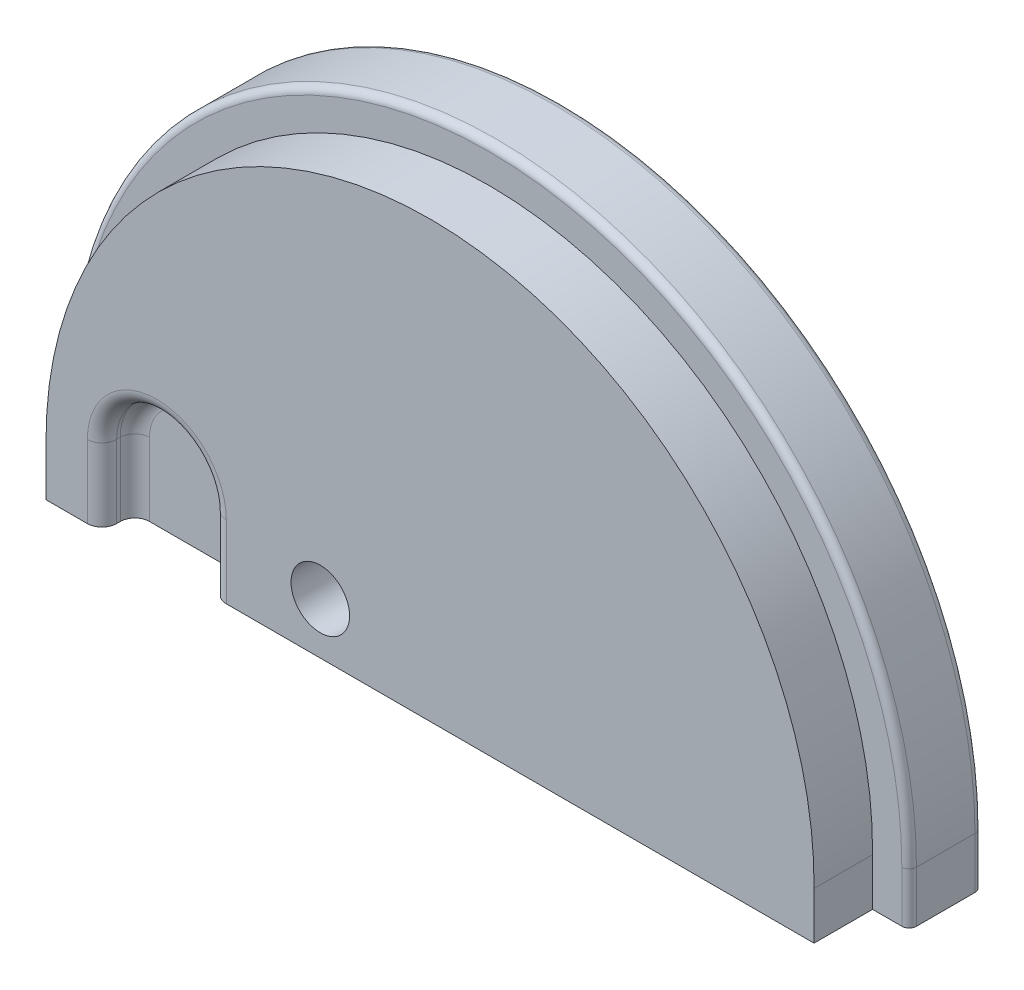
ISO-10303-21;
HEADER;
FILE_DESCRIPTION(('STEP AP214'),'2;1');
FILE_NAME('part.step','',(''),(''),'','','');
FILE_SCHEMA(('AUTOMOTIVE_DESIGN { 1 0 10303 214 1 1 1 1 }'));
ENDSEC;
DATA;
#1=APPLICATION_CONTEXT('core data for automotive mechanical design processes');
#2=APPLICATION_PROTOCOL_DEFINITION('international standard','automotive_design',2000,#1);
#3=PRODUCT_CONTEXT('',#1,'mechanical');
#4=PRODUCT('Part','Part','',(#3));
#5=PRODUCT_RELATED_PRODUCT_CATEGORY('part','',(#4));
#6=PRODUCT_DEFINITION_FORMATION('','',#4);
#7=PRODUCT_DEFINITION_CONTEXT('part definition',#1,'design');
#8=PRODUCT_DEFINITION('design','',#6,#7);
#9=PRODUCT_DEFINITION_SHAPE('','',#8);
#10=(LENGTH_UNIT() NAMED_UNIT(*) SI_UNIT(.MILLI.,.METRE.));
#11=(NAMED_UNIT(*) PLANE_ANGLE_UNIT() SI_UNIT($,.RADIAN.));
#12=(NAMED_UNIT(*) SI_UNIT($,.STERADIAN.) SOLID_ANGLE_UNIT());
#13=UNCERTAINTY_MEASURE_WITH_UNIT(LENGTH_MEASURE(1.E-05),#10,'distance_accuracy_value','');
#14=(GEOMETRIC_REPRESENTATION_CONTEXT(3) GLOBAL_UNCERTAINTY_ASSIGNED_CONTEXT((#13)) GLOBAL_UNIT_ASSIGNED_CONTEXT((#10,
#11,#12)) REPRESENTATION_CONTEXT('',''));
#15=CARTESIAN_POINT('',(0.,0.,0.));
#16=DIRECTION('',(0.,0.,1.));
#17=DIRECTION('',(1.,0.,0.));
#18=AXIS2_PLACEMENT_3D('',#15,#16,#17);
#19=CARTESIAN_POINT('',(49.7401472728543,48.7881442927304,-8.));
#20=DIRECTION('',(0.,1.,0.));
#21=DIRECTION('',(0.,0.,-1.));
#22=AXIS2_PLACEMENT_3D('',#19,#20,#21);
#23=PLANE('',#22);
#24=DIRECTION('',(0.,0.,1.));
#25=VECTOR('',#24,1.);
#26=CARTESIAN_POINT('',(72.3917820401487,48.7881442927304,-4.5));
#27=LINE('',#26,#25);
#28=CARTESIAN_POINT('',(72.3917820401487,48.7881442927304,-2.5));
#29=VERTEX_POINT('',#28);
#30=CARTESIAN_POINT('',(72.3917820401487,48.7881442927304,-2.));
#31=VERTEX_POINT('',#30);
#32=EDGE_CURVE('E355',#29,#31,#27,.T.);
#33=ORIENTED_EDGE('',*,*,#32,.F.);
#34=CARTESIAN_POINT('',(70.3917820401487,48.7881442927304,-2.5));
#35=DIRECTION('',(0.,-1.,0.));
#36=DIRECTION('',(0.,0.,-1.));
#37=AXIS2_PLACEMENT_3D('',#34,#35,#36);
#38=CIRCLE('',#37,2.);
#39=CARTESIAN_POINT('',(70.3917820401487,48.7881442927304,-4.5));
#40=VERTEX_POINT('',#39);
#41=EDGE_CURVE('E11',#40,#29,#38,.T.);
#42=ORIENTED_EDGE('',*,*,#41,.F.);
#43=DIRECTION('',(1.,0.,0.));
#44=VECTOR('',#43,1.);
#45=CARTESIAN_POINT('',(72.3917820401487,48.7881442927304,-4.5));
#46=LINE('',#45,#44);
#47=CARTESIAN_POINT('',(59.3917820401487,48.7881442927304,-4.5));
#48=VERTEX_POINT('',#47);
#49=EDGE_CURVE('E345',#48,#40,#46,.T.);
#50=ORIENTED_EDGE('',*,*,#49,.F.);
#51=CARTESIAN_POINT('',(59.3917820401487,48.7881442927304,-2.5));
#52=DIRECTION('',(0.,-1.,0.));
#53=DIRECTION('',(0.,0.,-1.));
#54=AXIS2_PLACEMENT_3D('',#51,#52,#53);
#55=CIRCLE('',#54,2.);
#56=CARTESIAN_POINT('',(57.3917820401487,48.7881442927304,-2.5));
#57=VERTEX_POINT('',#56);
#58=EDGE_CURVE('E42',#57,#48,#55,.T.);
#59=ORIENTED_EDGE('',*,*,#58,.F.);
#60=DIRECTION('',(0.,0.,1.));
#61=VECTOR('',#60,1.);
#62=CARTESIAN_POINT('',(57.3917820401487,48.7881442927304,-4.5));
#63=LINE('',#62,#61);
#64=CARTESIAN_POINT('',(57.3917820401487,48.7881442927304,-2.));
#65=VERTEX_POINT('',#64);
#66=EDGE_CURVE('E360',#57,#65,#63,.T.);
#67=ORIENTED_EDGE('',*,*,#66,.T.);
#68=CARTESIAN_POINT('',(55.3917820401487,48.7881442927304,-2.));
#69=DIRECTION('',(0.,-1.,0.));
#70=DIRECTION('',(0.,0.,-1.));
#71=AXIS2_PLACEMENT_3D('',#68,#69,#70);
#72=CIRCLE('',#71,2.);
#73=CARTESIAN_POINT('',(55.3917820401487,48.7881442927304,0.));
#74=VERTEX_POINT('',#73);
#75=EDGE_CURVE('E318',#74,#65,#72,.F.);
#76=ORIENTED_EDGE('',*,*,#75,.F.);
#77=DIRECTION('',(1.,0.,0.));
#78=VECTOR('',#77,1.);
#79=CARTESIAN_POINT('',(49.7401472728543,48.7881442927304,0.));
#80=LINE('',#79,#78);
#81=CARTESIAN_POINT('',(49.7401472728543,48.7881442927304,0.));
#82=VERTEX_POINT('',#81);
#83=EDGE_CURVE('E198',#82,#74,#80,.T.);
#84=ORIENTED_EDGE('',*,*,#83,.F.);
#85=DIRECTION('',(0.,0.,1.));
#86=VECTOR('',#85,1.);
#87=CARTESIAN_POINT('',(49.7401472728543,48.7881442927304,-8.));
#88=LINE('',#87,#86);
#89=CARTESIAN_POINT('',(49.7401472728543,48.7881442927297,-8.));
#90=VERTEX_POINT('',#89);
#91=EDGE_CURVE('E176',#90,#82,#88,.T.);
#92=ORIENTED_EDGE('',*,*,#91,.F.);
#93=DIRECTION('',(1.,0.,0.));
#94=VECTOR('',#93,1.);
#95=CARTESIAN_POINT('',(159.740147272854,48.7881442927297,-8.));
#96=LINE('',#95,#94);
#97=CARTESIAN_POINT('',(45.7401472728544,48.7881442927297,-8.));
#98=VERTEX_POINT('',#97);
#99=EDGE_CURVE('E184',#98,#90,#96,.T.);
#100=ORIENTED_EDGE('',*,*,#99,.F.);
#101=CARTESIAN_POINT('',(45.7401472728544,48.7881442927304,-9.));
#102=DIRECTION('',(0.,-1.,0.));
#103=DIRECTION('',(0.,0.,-1.));
#104=AXIS2_PLACEMENT_3D('',#101,#102,#103);
#105=CIRCLE('',#104,1.);
#106=CARTESIAN_POINT('',(44.7401472728544,48.7881442927297,-9.));
#107=VERTEX_POINT('',#106);
#108=EDGE_CURVE('E275',#107,#98,#105,.F.);
#109=ORIENTED_EDGE('',*,*,#108,.F.);
#110=DIRECTION('',(0.,0.,1.));
#111=VECTOR('',#110,1.);
#112=CARTESIAN_POINT('',(44.7401472728544,48.7881442927297,-18.));
#113=LINE('',#112,#111);
#114=CARTESIAN_POINT('',(44.7401472728544,48.7881442927297,-17.));
#115=VERTEX_POINT('',#114);
#116=EDGE_CURVE('E250',#115,#107,#113,.T.);
#117=ORIENTED_EDGE('',*,*,#116,.F.);
#118=CARTESIAN_POINT('',(45.7401472728544,48.7881442927304,-17.));
#119=DIRECTION('',(0.,-1.,0.));
#120=DIRECTION('',(0.,0.,-1.));
#121=AXIS2_PLACEMENT_3D('',#118,#119,#120);
#122=CIRCLE('',#121,1.);
#123=CARTESIAN_POINT('',(45.7401472728544,48.7881442927297,-18.));
#124=VERTEX_POINT('',#123);
#125=EDGE_CURVE('E269',#124,#115,#122,.F.);
#126=ORIENTED_EDGE('',*,*,#125,.F.);
#127=DIRECTION('',(1.,0.,0.));
#128=VECTOR('',#127,1.);
#129=CARTESIAN_POINT('',(159.740147272854,48.7881442927297,-18.));
#130=LINE('',#129,#128);
#131=CARTESIAN_POINT('',(158.740147272854,48.7881442927297,-18.));
#132=VERTEX_POINT('',#131);
#133=EDGE_CURVE('E192',#124,#132,#130,.T.);
#134=ORIENTED_EDGE('',*,*,#133,.T.);
#135=CARTESIAN_POINT('',(158.740147272854,48.7881442927304,-17.));
#136=DIRECTION('',(0.,-1.,0.));
#137=DIRECTION('',(0.,0.,-1.));
#138=AXIS2_PLACEMENT_3D('',#135,#136,#137);
#139=CIRCLE('',#138,1.);
#140=CARTESIAN_POINT('',(159.740147272854,48.7881442927297,-17.));
#141=VERTEX_POINT('',#140);
#142=EDGE_CURVE('E272',#141,#132,#139,.F.);
#143=ORIENTED_EDGE('',*,*,#142,.F.);
#144=DIRECTION('',(0.,0.,1.));
#145=VECTOR('',#144,1.);
#146=CARTESIAN_POINT('',(159.740147272854,48.7881442927297,-18.));
#147=LINE('',#146,#145);
#148=CARTESIAN_POINT('',(159.740147272854,48.7881442927297,-9.));
#149=VERTEX_POINT('',#148);
#150=EDGE_CURVE('E480',#141,#149,#147,.T.);
#151=ORIENTED_EDGE('',*,*,#150,.T.);
#152=CARTESIAN_POINT('',(158.740147272854,48.7881442927304,-9.));
#153=DIRECTION('',(0.,-1.,0.));
#154=DIRECTION('',(0.,0.,-1.));
#155=AXIS2_PLACEMENT_3D('',#152,#153,#154);
#156=CIRCLE('',#155,1.);
#157=CARTESIAN_POINT('',(158.740147272854,48.7881442927297,-8.));
#158=VERTEX_POINT('',#157);
#159=EDGE_CURVE('E243',#158,#149,#156,.F.);
#160=ORIENTED_EDGE('',*,*,#159,.F.);
#161=CARTESIAN_POINT('',(154.737534778382,48.7881442927304,-8.));
#162=VERTEX_POINT('',#161);
#163=EDGE_CURVE('E193',#162,#158,#96,.T.);
#164=ORIENTED_EDGE('',*,*,#163,.F.);
#165=DIRECTION('',(0.,0.,1.));
#166=VECTOR('',#165,1.);
#167=CARTESIAN_POINT('',(154.737534778382,48.7881442927304,-8.));
#168=LINE('',#167,#166);
#169=CARTESIAN_POINT('',(154.737534778382,48.7881442927304,0.));
#170=VERTEX_POINT('',#169);
#171=EDGE_CURVE('E235',#162,#170,#168,.T.);
#172=ORIENTED_EDGE('',*,*,#171,.T.);
#173=CARTESIAN_POINT('',(74.3917820401487,48.7881442927304,0.));
#174=VERTEX_POINT('',#173);
#175=EDGE_CURVE('E215',#174,#170,#80,.T.);
#176=ORIENTED_EDGE('',*,*,#175,.F.);
#177=CARTESIAN_POINT('',(74.3917820401487,48.7881442927304,-2.));
#178=DIRECTION('',(0.,-1.,0.));
#179=DIRECTION('',(0.,0.,-1.));
#180=AXIS2_PLACEMENT_3D('',#177,#178,#179);
#181=CIRCLE('',#180,2.);
#182=EDGE_CURVE('E321',#31,#174,#181,.F.);
#183=ORIENTED_EDGE('',*,*,#182,.F.);
#184=EDGE_LOOP('',(#33,#42,#50,#59,#67,#76,#84,#92,#100,#109,#117,#126,#134,#143,#151,#160,#164,
#172,#176,#183));
#185=FACE_BOUND('',#184,.T.);
#186=ADVANCED_FACE('F33',(#185),#23,.F.);
#187=CARTESIAN_POINT('',(102.240147272854,55.7881442927283,0.));
#188=DIRECTION('',(0.,0.,1.));
#189=DIRECTION('',(-1.,0.,0.));
#190=AXIS2_PLACEMENT_3D('',#187,#188,#189);
#191=PLANE('',#190);
#192=ORIENTED_EDGE('',*,*,#175,.T.);
#193=DIRECTION('',(0.,1.,0.));
#194=VECTOR('',#193,1.);
#195=CARTESIAN_POINT('',(154.737534778382,48.7881442927304,0.));
#196=LINE('',#195,#194);
#197=CARTESIAN_POINT('',(154.737534778382,55.2644028541581,0.));
#198=VERTEX_POINT('',#197);
#199=EDGE_CURVE('E214',#170,#198,#196,.T.);
#200=ORIENTED_EDGE('',*,*,#199,.T.);
#201=CARTESIAN_POINT('',(102.240147272854,55.7881442927283,0.));
#202=DIRECTION('',(0.,0.,1.));
#203=DIRECTION('',(-1.,0.,0.));
#204=AXIS2_PLACEMENT_3D('',#201,#202,#203);
#205=CIRCLE('',#204,52.5);
#206=CARTESIAN_POINT('',(49.7401472728543,55.7881442927283,0.));
#207=VERTEX_POINT('',#206);
#208=EDGE_CURVE('E218',#198,#207,#205,.T.);
#209=ORIENTED_EDGE('',*,*,#208,.T.);
#210=DIRECTION('',(0.,-1.,0.));
#211=VECTOR('',#210,1.);
#212=CARTESIAN_POINT('',(49.7401472728543,55.7881442927283,0.));
#213=LINE('',#212,#211);
#214=EDGE_CURVE('E221',#207,#82,#213,.T.);
#215=ORIENTED_EDGE('',*,*,#214,.T.);
#216=ORIENTED_EDGE('',*,*,#83,.T.);
#217=DIRECTION('',(0.,-1.,0.));
#218=VECTOR('',#217,1.);
#219=CARTESIAN_POINT('',(55.3917820401487,55.7881442927283,0.));
#220=LINE('',#219,#218);
#221=CARTESIAN_POINT('',(55.3917820401487,58.7546680660623,0.));
#222=VERTEX_POINT('',#221);
#223=EDGE_CURVE('E309',#222,#74,#220,.T.);
#224=ORIENTED_EDGE('',*,*,#223,.F.);
#225=CARTESIAN_POINT('',(64.8917820401487,58.7546680660623,0.));
#226=DIRECTION('',(0.,0.,-1.));
#227=DIRECTION('',(-1.,0.,0.));
#228=AXIS2_PLACEMENT_3D('',#225,#226,#227);
#229=CIRCLE('',#228,9.49999999999998);
#230=CARTESIAN_POINT('',(74.3917820401487,58.7546680660623,0.));
#231=VERTEX_POINT('',#230);
#232=EDGE_CURVE('E297',#231,#222,#229,.F.);
#233=ORIENTED_EDGE('',*,*,#232,.F.);
#234=DIRECTION('',(0.,1.,0.));
#235=VECTOR('',#234,1.);
#236=CARTESIAN_POINT('',(74.3917820401487,55.7881442927283,0.));
#237=LINE('',#236,#235);
#238=EDGE_CURVE('E311',#174,#231,#237,.T.);
#239=ORIENTED_EDGE('',*,*,#238,.F.);
#240=EDGE_LOOP('',(#192,#200,#209,#215,#216,#224,#233,#239));
#241=FACE_BOUND('',#240,.T.);
#242=CARTESIAN_POINT('',(87.2401472728543,55.7881442927304,0.));
#243=DIRECTION('',(0.,0.,-1.));
#244=DIRECTION('',(-1.,0.,0.));
#245=AXIS2_PLACEMENT_3D('',#242,#243,#244);
#246=CIRCLE('',#245,4.00000000000001);
#247=CARTESIAN_POINT('',(83.2401472728543,55.7881442927304,0.));
#248=VERTEX_POINT('',#247);
#249=EDGE_CURVE('E246',#248,#248,#246,.F.);
#250=ORIENTED_EDGE('',*,*,#249,.F.);
#251=EDGE_LOOP('',(#250));
#252=FACE_BOUND('',#251,.T.);
#253=ADVANCED_FACE('F369',(#241,#252),#191,.T.);
#254=CARTESIAN_POINT('',(154.737534778382,48.7881442927304,-8.));
#255=DIRECTION('',(-1.,0.,0.));
#256=DIRECTION('',(0.,0.,-1.));
#257=AXIS2_PLACEMENT_3D('',#254,#255,#256);
#258=PLANE('',#257);
#259=ORIENTED_EDGE('',*,*,#199,.F.);
#260=ORIENTED_EDGE('',*,*,#171,.F.);
#261=DIRECTION('',(0.,1.,0.));
#262=VECTOR('',#261,1.);
#263=CARTESIAN_POINT('',(154.737534778382,48.7881442927304,-8.));
#264=LINE('',#263,#262);
#265=CARTESIAN_POINT('',(154.737534778382,55.2644028541581,-8.));
#266=VERTEX_POINT('',#265);
#267=EDGE_CURVE('E207',#162,#266,#264,.T.);
#268=ORIENTED_EDGE('',*,*,#267,.T.);
#269=DIRECTION('',(0.,0.,1.));
#270=VECTOR('',#269,1.);
#271=CARTESIAN_POINT('',(154.737534778382,55.2644028541581,-8.));
#272=LINE('',#271,#270);
#273=EDGE_CURVE('E200',#266,#198,#272,.T.);
#274=ORIENTED_EDGE('',*,*,#273,.T.);
#275=EDGE_LOOP('',(#259,#260,#268,#274));
#276=FACE_BOUND('',#275,.T.);
#277=ADVANCED_FACE('F236',(#276),#258,.F.);
#278=CARTESIAN_POINT('',(102.240147272854,55.7881442927283,-8.));
#279=DIRECTION('',(0.,0.,1.));
#280=DIRECTION('',(-1.,0.,0.));
#281=AXIS2_PLACEMENT_3D('',#278,#279,#280);
#282=CYLINDRICAL_SURFACE('',#281,52.5);
#283=ORIENTED_EDGE('',*,*,#208,.F.);
#284=ORIENTED_EDGE('',*,*,#273,.F.);
#285=CARTESIAN_POINT('',(102.240147272854,55.7881442927283,-8.));
#286=DIRECTION('',(0.,0.,1.));
#287=DIRECTION('',(-1.,0.,0.));
#288=AXIS2_PLACEMENT_3D('',#285,#286,#287);
#289=CIRCLE('',#288,52.5);
#290=CARTESIAN_POINT('',(49.7401472728543,55.7881442927283,-8.));
#291=VERTEX_POINT('',#290);
#292=EDGE_CURVE('E181',#266,#291,#289,.T.);
#293=ORIENTED_EDGE('',*,*,#292,.T.);
#294=DIRECTION('',(0.,0.,1.));
#295=VECTOR('',#294,1.);
#296=CARTESIAN_POINT('',(49.7401472728543,55.7881442927283,-8.));
#297=LINE('',#296,#295);
#298=EDGE_CURVE('E178',#291,#207,#297,.T.);
#299=ORIENTED_EDGE('',*,*,#298,.T.);
#300=EDGE_LOOP('',(#283,#284,#293,#299));
#301=FACE_BOUND('',#300,.T.);
#302=ADVANCED_FACE('F229',(#301),#282,.T.);
#303=CARTESIAN_POINT('',(49.7401472728543,55.7881442927283,-8.));
#304=DIRECTION('',(1.,0.,0.));
#305=DIRECTION('',(0.,0.,1.));
#306=AXIS2_PLACEMENT_3D('',#303,#304,#305);
#307=PLANE('',#306);
#308=ORIENTED_EDGE('',*,*,#214,.F.);
#309=ORIENTED_EDGE('',*,*,#298,.F.);
#310=DIRECTION('',(0.,-1.,0.));
#311=VECTOR('',#310,1.);
#312=CARTESIAN_POINT('',(49.7401472728543,55.7881442927283,-8.));
#313=LINE('',#312,#311);
#314=EDGE_CURVE('E171',#291,#90,#313,.T.);
#315=ORIENTED_EDGE('',*,*,#314,.T.);
#316=ORIENTED_EDGE('',*,*,#91,.T.);
#317=EDGE_LOOP('',(#308,#309,#315,#316));
#318=FACE_BOUND('',#317,.T.);
#319=ADVANCED_FACE('F174',(#318),#307,.F.);
#320=CARTESIAN_POINT('',(44.7401472728544,55.7881442927304,-18.));
#321=DIRECTION('',(1.,0.,0.));
#322=DIRECTION('',(0.,0.,1.));
#323=AXIS2_PLACEMENT_3D('',#320,#321,#322);
#324=PLANE('',#323);
#325=DIRECTION('',(0.,0.,1.));
#326=VECTOR('',#325,1.);
#327=CARTESIAN_POINT('',(44.7401472728544,55.7881442927304,-18.));
#328=LINE('',#327,#326);
#329=CARTESIAN_POINT('',(44.7401472728544,55.7881442927304,-17.));
#330=VERTEX_POINT('',#329);
#331=CARTESIAN_POINT('',(44.7401472728544,55.7881442927304,-9.));
#332=VERTEX_POINT('',#331);
#333=EDGE_CURVE('E256',#330,#332,#328,.T.);
#334=ORIENTED_EDGE('',*,*,#333,.F.);
#335=DIRECTION('',(0.,-1.,0.));
#336=VECTOR('',#335,1.);
#337=CARTESIAN_POINT('',(44.7401472728544,55.7881442927304,-17.));
#338=LINE('',#337,#336);
#339=EDGE_CURVE('E278',#115,#330,#338,.F.);
#340=ORIENTED_EDGE('',*,*,#339,.F.);
#341=ORIENTED_EDGE('',*,*,#116,.T.);
#342=DIRECTION('',(0.,-1.,0.));
#343=VECTOR('',#342,1.);
#344=CARTESIAN_POINT('',(44.7401472728544,48.7881442927297,-9.));
#345=LINE('',#344,#343);
#346=EDGE_CURVE('E281',#332,#107,#345,.T.);
#347=ORIENTED_EDGE('',*,*,#346,.F.);
#348=EDGE_LOOP('',(#334,#340,#341,#347));
#349=FACE_BOUND('',#348,.T.);
#350=ADVANCED_FACE('F380',(#349),#324,.F.);
#351=CARTESIAN_POINT('',(159.740147272854,55.7881442927304,-18.));
#352=DIRECTION('',(-1.,0.,0.));
#353=DIRECTION('',(0.,0.,-1.));
#354=AXIS2_PLACEMENT_3D('',#351,#352,#353);
#355=PLANE('',#354);
#356=ORIENTED_EDGE('',*,*,#150,.F.);
#357=DIRECTION('',(0.,1.,0.));
#358=VECTOR('',#357,1.);
#359=CARTESIAN_POINT('',(159.740147272854,55.7881442927304,-17.));
#360=LINE('',#359,#358);
#361=CARTESIAN_POINT('',(159.740147272854,55.7881442927304,-17.));
#362=VERTEX_POINT('',#361);
#363=EDGE_CURVE('E239',#362,#141,#360,.F.);
#364=ORIENTED_EDGE('',*,*,#363,.F.);
#365=DIRECTION('',(0.,0.,1.));
#366=VECTOR('',#365,1.);
#367=CARTESIAN_POINT('',(159.740147272854,55.7881442927304,-18.));
#368=LINE('',#367,#366);
#369=CARTESIAN_POINT('',(159.740147272854,55.7881442927304,-9.));
#370=VERTEX_POINT('',#369);
#371=EDGE_CURVE('E484',#362,#370,#368,.T.);
#372=ORIENTED_EDGE('',*,*,#371,.T.);
#373=DIRECTION('',(0.,1.,0.));
#374=VECTOR('',#373,1.);
#375=CARTESIAN_POINT('',(159.740147272854,55.7881442927304,-9.));
#376=LINE('',#375,#374);
#377=EDGE_CURVE('E261',#149,#370,#376,.T.);
#378=ORIENTED_EDGE('',*,*,#377,.F.);
#379=EDGE_LOOP('',(#356,#364,#372,#378));
#380=FACE_BOUND('',#379,.T.);
#381=ADVANCED_FACE('F470',(#380),#355,.F.);
#382=CARTESIAN_POINT('',(102.240147272854,55.7881442927304,-18.));
#383=DIRECTION('',(0.,0.,1.));
#384=DIRECTION('',(-1.,0.,0.));
#385=AXIS2_PLACEMENT_3D('',#382,#383,#384);
#386=CYLINDRICAL_SURFACE('',#385,57.5);
#387=ORIENTED_EDGE('',*,*,#371,.F.);
#388=CARTESIAN_POINT('',(102.240147272854,55.7881442927304,-17.));
#389=DIRECTION('',(0.,0.,-1.));
#390=DIRECTION('',(-1.,0.,0.));
#391=AXIS2_PLACEMENT_3D('',#388,#389,#390);
#392=CIRCLE('',#391,57.5);
#393=EDGE_CURVE('E291',#330,#362,#392,.T.);
#394=ORIENTED_EDGE('',*,*,#393,.F.);
#395=ORIENTED_EDGE('',*,*,#333,.T.);
#396=CARTESIAN_POINT('',(102.240147272854,55.7881442927304,-9.));
#397=DIRECTION('',(0.,0.,-1.));
#398=DIRECTION('',(-1.,0.,0.));
#399=AXIS2_PLACEMENT_3D('',#396,#397,#398);
#400=CIRCLE('',#399,57.5);
#401=EDGE_CURVE('E294',#370,#332,#400,.F.);
#402=ORIENTED_EDGE('',*,*,#401,.F.);
#403=EDGE_LOOP('',(#387,#394,#395,#402));
#404=FACE_BOUND('',#403,.T.);
#405=ADVANCED_FACE('F465',(#404),#386,.T.);
#406=CARTESIAN_POINT('',(102.240147272854,55.7881442927304,-18.));
#407=DIRECTION('',(0.,0.,1.));
#408=DIRECTION('',(-1.,0.,0.));
#409=AXIS2_PLACEMENT_3D('',#406,#407,#408);
#410=PLANE('',#409);
#411=ORIENTED_EDGE('',*,*,#133,.F.);
#412=DIRECTION('',(0.,-1.,0.));
#413=VECTOR('',#412,1.);
#414=CARTESIAN_POINT('',(45.7401472728544,55.7881442927304,-18.));
#415=LINE('',#414,#413);
#416=CARTESIAN_POINT('',(45.7401472728544,55.7881442927304,-18.));
#417=VERTEX_POINT('',#416);
#418=EDGE_CURVE('E286',#417,#124,#415,.T.);
#419=ORIENTED_EDGE('',*,*,#418,.F.);
#420=CARTESIAN_POINT('',(102.240147272854,55.7881442927304,-18.));
#421=DIRECTION('',(0.,0.,-1.));
#422=DIRECTION('',(-1.,0.,0.));
#423=AXIS2_PLACEMENT_3D('',#420,#421,#422);
#424=CIRCLE('',#423,56.5);
#425=CARTESIAN_POINT('',(158.740147272854,55.7881442927304,-18.));
#426=VERTEX_POINT('',#425);
#427=EDGE_CURVE('E283',#426,#417,#424,.F.);
#428=ORIENTED_EDGE('',*,*,#427,.F.);
#429=DIRECTION('',(0.,1.,0.));
#430=VECTOR('',#429,1.);
#431=CARTESIAN_POINT('',(158.740147272854,55.7881442927304,-18.));
#432=LINE('',#431,#430);
#433=EDGE_CURVE('E288',#132,#426,#432,.T.);
#434=ORIENTED_EDGE('',*,*,#433,.F.);
#435=EDGE_LOOP('',(#411,#419,#428,#434));
#436=FACE_BOUND('',#435,.T.);
#437=CARTESIAN_POINT('',(87.2401472728543,55.7881442927304,-18.));
#438=DIRECTION('',(0.,0.,1.));
#439=DIRECTION('',(1.,0.,0.));
#440=AXIS2_PLACEMENT_3D('',#437,#438,#439);
#441=CIRCLE('',#440,4.00000000000001);
#442=CARTESIAN_POINT('',(91.2401472728543,55.7881442927304,-18.));
#443=VERTEX_POINT('',#442);
#444=EDGE_CURVE('E244',#443,#443,#441,.T.);
#445=ORIENTED_EDGE('',*,*,#444,.T.);
#446=EDGE_LOOP('',(#445));
#447=FACE_BOUND('',#446,.T.);
#448=ADVANCED_FACE('F462',(#436,#447),#410,.F.);
#449=CARTESIAN_POINT('',(102.240147272854,55.7881442927304,-8.));
#450=DIRECTION('',(0.,0.,1.));
#451=DIRECTION('',(-1.,0.,0.));
#452=AXIS2_PLACEMENT_3D('',#449,#450,#451);
#453=PLANE('',#452);
#454=CARTESIAN_POINT('',(102.240147272854,55.7881442927304,-8.));
#455=DIRECTION('',(0.,0.,-1.));
#456=DIRECTION('',(-1.,0.,0.));
#457=AXIS2_PLACEMENT_3D('',#454,#455,#456);
#458=CIRCLE('',#457,56.5);
#459=CARTESIAN_POINT('',(45.7401472728544,55.7881442927304,-8.));
#460=VERTEX_POINT('',#459);
#461=CARTESIAN_POINT('',(158.740147272854,55.7881442927304,-8.));
#462=VERTEX_POINT('',#461);
#463=EDGE_CURVE('E263',#460,#462,#458,.T.);
#464=ORIENTED_EDGE('',*,*,#463,.F.);
#465=DIRECTION('',(0.,-1.,0.));
#466=VECTOR('',#465,1.);
#467=CARTESIAN_POINT('',(45.7401472728544,55.7881442927304,-8.));
#468=LINE('',#467,#466);
#469=EDGE_CURVE('E188',#98,#460,#468,.F.);
#470=ORIENTED_EDGE('',*,*,#469,.F.);
#471=ORIENTED_EDGE('',*,*,#99,.T.);
#472=ORIENTED_EDGE('',*,*,#314,.F.);
#473=ORIENTED_EDGE('',*,*,#292,.F.);
#474=ORIENTED_EDGE('',*,*,#267,.F.);
#475=ORIENTED_EDGE('',*,*,#163,.T.);
#476=DIRECTION('',(0.,1.,0.));
#477=VECTOR('',#476,1.);
#478=CARTESIAN_POINT('',(158.740147272854,48.7881442927297,-8.));
#479=LINE('',#478,#477);
#480=EDGE_CURVE('E267',#462,#158,#479,.F.);
#481=ORIENTED_EDGE('',*,*,#480,.F.);
#482=EDGE_LOOP('',(#464,#470,#471,#472,#473,#474,#475,#481));
#483=FACE_BOUND('',#482,.T.);
#484=ADVANCED_FACE('F186',(#483),#453,.T.);
#485=CARTESIAN_POINT('',(87.2401472728543,55.7881442927304,500000.));
#486=DIRECTION('',(0.,0.,-1.));
#487=DIRECTION('',(1.,0.,0.));
#488=AXIS2_PLACEMENT_3D('',#485,#486,#487);
#489=CYLINDRICAL_SURFACE('',#488,4.00000000000001);
#490=ORIENTED_EDGE('',*,*,#444,.F.);
#491=EDGE_LOOP('',(#490));
#492=FACE_BOUND('',#491,.T.);
#493=ORIENTED_EDGE('',*,*,#249,.T.);
#494=EDGE_LOOP('',(#493));
#495=FACE_BOUND('',#494,.T.);
#496=ADVANCED_FACE('F367',(#492,#495),#489,.F.);
#497=CARTESIAN_POINT('',(45.7401472728544,55.7881442927304,-9.));
#498=DIRECTION('',(0.,1.,0.));
#499=DIRECTION('',(0.,0.,-1.));
#500=AXIS2_PLACEMENT_3D('',#497,#498,#499);
#501=CYLINDRICAL_SURFACE('',#500,1.);
#502=ORIENTED_EDGE('',*,*,#108,.T.);
#503=ORIENTED_EDGE('',*,*,#469,.T.);
#504=CARTESIAN_POINT('',(45.7401472728544,55.7881442927304,-9.));
#505=DIRECTION('',(0.,-1.,0.));
#506=DIRECTION('',(0.,0.,-1.));
#507=AXIS2_PLACEMENT_3D('',#504,#505,#506);
#508=CIRCLE('',#507,1.);
#509=EDGE_CURVE('E300',#460,#332,#508,.T.);
#510=ORIENTED_EDGE('',*,*,#509,.T.);
#511=ORIENTED_EDGE('',*,*,#346,.T.);
#512=EDGE_LOOP('',(#502,#503,#510,#511));
#513=FACE_BOUND('',#512,.T.);
#514=ADVANCED_FACE('F394',(#513),#501,.T.);
#515=CARTESIAN_POINT('',(102.240147272854,55.7881442927304,-9.));
#516=DIRECTION('',(0.,0.,1.));
#517=DIRECTION('',(-1.,0.,0.));
#518=AXIS2_PLACEMENT_3D('',#515,#516,#517);
#519=TOROIDAL_SURFACE('',#518,56.5,1.);
#520=ORIENTED_EDGE('',*,*,#509,.F.);
#521=ORIENTED_EDGE('',*,*,#463,.T.);
#522=CARTESIAN_POINT('',(158.740147272854,55.7881442927304,-9.));
#523=DIRECTION('',(0.,1.,0.));
#524=DIRECTION('',(0.,0.,1.));
#525=AXIS2_PLACEMENT_3D('',#522,#523,#524);
#526=CIRCLE('',#525,1.);
#527=EDGE_CURVE('E298',#462,#370,#526,.T.);
#528=ORIENTED_EDGE('',*,*,#527,.T.);
#529=ORIENTED_EDGE('',*,*,#401,.T.);
#530=EDGE_LOOP('',(#520,#521,#528,#529));
#531=FACE_BOUND('',#530,.T.);
#532=ADVANCED_FACE('F390',(#531),#519,.T.);
#533=CARTESIAN_POINT('',(158.740147272854,55.7881442927304,-9.));
#534=DIRECTION('',(0.,-1.,0.));
#535=DIRECTION('',(0.,0.,1.));
#536=AXIS2_PLACEMENT_3D('',#533,#534,#535);
#537=CYLINDRICAL_SURFACE('',#536,1.);
#538=ORIENTED_EDGE('',*,*,#159,.T.);
#539=ORIENTED_EDGE('',*,*,#377,.T.);
#540=ORIENTED_EDGE('',*,*,#527,.F.);
#541=ORIENTED_EDGE('',*,*,#480,.T.);
#542=EDGE_LOOP('',(#538,#539,#540,#541));
#543=FACE_BOUND('',#542,.T.);
#544=ADVANCED_FACE('F386',(#543),#537,.T.);
#545=CARTESIAN_POINT('',(45.7401472728544,55.7881442927304,-17.));
#546=DIRECTION('',(0.,-1.,0.));
#547=DIRECTION('',(0.,0.,1.));
#548=AXIS2_PLACEMENT_3D('',#545,#546,#547);
#549=CYLINDRICAL_SURFACE('',#548,1.);
#550=ORIENTED_EDGE('',*,*,#125,.T.);
#551=ORIENTED_EDGE('',*,*,#339,.T.);
#552=CARTESIAN_POINT('',(45.7401472728544,55.7881442927304,-17.));
#553=DIRECTION('',(0.,-1.,0.));
#554=DIRECTION('',(0.,0.,-1.));
#555=AXIS2_PLACEMENT_3D('',#552,#553,#554);
#556=CIRCLE('',#555,1.);
#557=EDGE_CURVE('E301',#330,#417,#556,.T.);
#558=ORIENTED_EDGE('',*,*,#557,.T.);
#559=ORIENTED_EDGE('',*,*,#418,.T.);
#560=EDGE_LOOP('',(#550,#551,#558,#559));
#561=FACE_BOUND('',#560,.T.);
#562=ADVANCED_FACE('F389',(#561),#549,.T.);
#563=CARTESIAN_POINT('',(102.240147272854,55.7881442927304,-17.));
#564=DIRECTION('',(0.,0.,1.));
#565=DIRECTION('',(-1.,0.,0.));
#566=AXIS2_PLACEMENT_3D('',#563,#564,#565);
#567=TOROIDAL_SURFACE('',#566,56.5,1.);
#568=ORIENTED_EDGE('',*,*,#557,.F.);
#569=ORIENTED_EDGE('',*,*,#393,.T.);
#570=CARTESIAN_POINT('',(158.740147272854,55.7881442927304,-17.));
#571=DIRECTION('',(0.,1.,0.));
#572=DIRECTION('',(0.,0.,1.));
#573=AXIS2_PLACEMENT_3D('',#570,#571,#572);
#574=CIRCLE('',#573,1.);
#575=EDGE_CURVE('E303',#362,#426,#574,.T.);
#576=ORIENTED_EDGE('',*,*,#575,.T.);
#577=ORIENTED_EDGE('',*,*,#427,.T.);
#578=EDGE_LOOP('',(#568,#569,#576,#577));
#579=FACE_BOUND('',#578,.T.);
#580=ADVANCED_FACE('F403',(#579),#567,.T.);
#581=CARTESIAN_POINT('',(158.740147272854,55.7881442927304,-17.));
#582=DIRECTION('',(0.,1.,0.));
#583=DIRECTION('',(0.,0.,-1.));
#584=AXIS2_PLACEMENT_3D('',#581,#582,#583);
#585=CYLINDRICAL_SURFACE('',#584,1.);
#586=ORIENTED_EDGE('',*,*,#142,.T.);
#587=ORIENTED_EDGE('',*,*,#433,.T.);
#588=ORIENTED_EDGE('',*,*,#575,.F.);
#589=ORIENTED_EDGE('',*,*,#363,.T.);
#590=EDGE_LOOP('',(#586,#587,#588,#589));
#591=FACE_BOUND('',#590,.T.);
#592=ADVANCED_FACE('F399',(#591),#585,.T.);
#593=CARTESIAN_POINT('',(64.8917820401487,58.7546680660623,-4.5));
#594=DIRECTION('',(0.,0.,1.));
#595=DIRECTION('',(-1.,0.,0.));
#596=AXIS2_PLACEMENT_3D('',#593,#594,#595);
#597=CYLINDRICAL_SURFACE('',#596,7.49999999999998);
#598=DIRECTION('',(0.,0.,1.));
#599=VECTOR('',#598,1.);
#600=CARTESIAN_POINT('',(72.3917820401487,58.7546680660623,-4.5));
#601=LINE('',#600,#599);
#602=CARTESIAN_POINT('',(72.3917820401487,58.7546680660623,-2.5));
#603=VERTEX_POINT('',#602);
#604=CARTESIAN_POINT('',(72.3917820401487,58.7546680660623,-2.));
#605=VERTEX_POINT('',#604);
#606=EDGE_CURVE('E348',#603,#605,#601,.T.);
#607=ORIENTED_EDGE('',*,*,#606,.T.);
#608=CARTESIAN_POINT('',(64.8917820401487,58.7546680660623,-2.));
#609=DIRECTION('',(0.,0.,-1.));
#610=DIRECTION('',(-1.,0.,0.));
#611=AXIS2_PLACEMENT_3D('',#608,#609,#610);
#612=CIRCLE('',#611,7.49999999999998);
#613=CARTESIAN_POINT('',(57.3917820401487,58.7546680660623,-2.));
#614=VERTEX_POINT('',#613);
#615=EDGE_CURVE('E335',#614,#605,#612,.T.);
#616=ORIENTED_EDGE('',*,*,#615,.F.);
#617=DIRECTION('',(0.,0.,1.));
#618=VECTOR('',#617,1.);
#619=CARTESIAN_POINT('',(57.3917820401487,58.7546680660623,-4.5));
#620=LINE('',#619,#618);
#621=CARTESIAN_POINT('',(57.3917820401487,58.7546680660623,-2.5));
#622=VERTEX_POINT('',#621);
#623=EDGE_CURVE('E305',#622,#614,#620,.T.);
#624=ORIENTED_EDGE('',*,*,#623,.F.);
#625=CARTESIAN_POINT('',(64.8917820401487,58.7546680660623,-2.5));
#626=DIRECTION('',(0.,0.,1.));
#627=DIRECTION('',(1.,0.,0.));
#628=AXIS2_PLACEMENT_3D('',#625,#626,#627);
#629=CIRCLE('',#628,7.49999999999998);
#630=EDGE_CURVE('E338',#603,#622,#629,.T.);
#631=ORIENTED_EDGE('',*,*,#630,.F.);
#632=EDGE_LOOP('',(#607,#616,#624,#631));
#633=FACE_BOUND('',#632,.T.);
#634=ADVANCED_FACE('F402',(#633),#597,.F.);
#635=CARTESIAN_POINT('',(57.3917820401487,48.7881442927304,-4.5));
#636=DIRECTION('',(1.,0.,0.));
#637=DIRECTION('',(0.,0.,1.));
#638=AXIS2_PLACEMENT_3D('',#635,#636,#637);
#639=PLANE('',#638);
#640=ORIENTED_EDGE('',*,*,#66,.F.);
#641=DIRECTION('',(0.,-1.,0.));
#642=VECTOR('',#641,1.);
#643=CARTESIAN_POINT('',(57.3917820401487,48.7881442927304,-2.5));
#644=LINE('',#643,#642);
#645=EDGE_CURVE('E324',#622,#57,#644,.T.);
#646=ORIENTED_EDGE('',*,*,#645,.F.);
#647=ORIENTED_EDGE('',*,*,#623,.T.);
#648=DIRECTION('',(0.,-1.,0.));
#649=VECTOR('',#648,1.);
#650=CARTESIAN_POINT('',(57.3917820401487,48.7881442927304,-2.));
#651=LINE('',#650,#649);
#652=EDGE_CURVE('E326',#65,#614,#651,.F.);
#653=ORIENTED_EDGE('',*,*,#652,.F.);
#654=EDGE_LOOP('',(#640,#646,#647,#653));
#655=FACE_BOUND('',#654,.T.);
#656=ADVANCED_FACE('F446',(#655),#639,.T.);
#657=CARTESIAN_POINT('',(72.3917820401487,58.7546680660623,-4.5));
#658=DIRECTION('',(-1.,0.,0.));
#659=DIRECTION('',(0.,0.,-1.));
#660=AXIS2_PLACEMENT_3D('',#657,#658,#659);
#661=PLANE('',#660);
#662=ORIENTED_EDGE('',*,*,#606,.F.);
#663=DIRECTION('',(0.,1.,0.));
#664=VECTOR('',#663,1.);
#665=CARTESIAN_POINT('',(72.3917820401487,58.7546680660623,-2.5));
#666=LINE('',#665,#664);
#667=EDGE_CURVE('E314',#29,#603,#666,.T.);
#668=ORIENTED_EDGE('',*,*,#667,.F.);
#669=ORIENTED_EDGE('',*,*,#32,.T.);
#670=DIRECTION('',(0.,1.,0.));
#671=VECTOR('',#670,1.);
#672=CARTESIAN_POINT('',(72.3917820401487,58.7546680660623,-2.));
#673=LINE('',#672,#671);
#674=EDGE_CURVE('E316',#605,#31,#673,.F.);
#675=ORIENTED_EDGE('',*,*,#674,.F.);
#676=EDGE_LOOP('',(#662,#668,#669,#675));
#677=FACE_BOUND('',#676,.T.);
#678=ADVANCED_FACE('F439',(#677),#661,.T.);
#679=CARTESIAN_POINT('',(64.8917820401487,58.7546680660623,-4.5));
#680=DIRECTION('',(0.,0.,-1.));
#681=DIRECTION('',(1.,0.,0.));
#682=AXIS2_PLACEMENT_3D('',#679,#680,#681);
#683=PLANE('',#682);
#684=ORIENTED_EDGE('',*,*,#49,.T.);
#685=DIRECTION('',(0.,1.,0.));
#686=VECTOR('',#685,1.);
#687=CARTESIAN_POINT('',(70.3917820401487,58.7546680660623,-4.5));
#688=LINE('',#687,#686);
#689=CARTESIAN_POINT('',(70.3917820401487,58.7546680660623,-4.5));
#690=VERTEX_POINT('',#689);
#691=EDGE_CURVE('E329',#690,#40,#688,.F.);
#692=ORIENTED_EDGE('',*,*,#691,.F.);
#693=CARTESIAN_POINT('',(64.8917820401487,58.7546680660623,-4.5));
#694=DIRECTION('',(0.,0.,1.));
#695=DIRECTION('',(1.,0.,0.));
#696=AXIS2_PLACEMENT_3D('',#693,#694,#695);
#697=CIRCLE('',#696,5.49999999999998);
#698=CARTESIAN_POINT('',(59.3917820401487,58.7546680660623,-4.5));
#699=VERTEX_POINT('',#698);
#700=EDGE_CURVE('E331',#699,#690,#697,.F.);
#701=ORIENTED_EDGE('',*,*,#700,.F.);
#702=DIRECTION('',(0.,-1.,0.));
#703=VECTOR('',#702,1.);
#704=CARTESIAN_POINT('',(59.3917820401487,58.7546680660623,-4.5));
#705=LINE('',#704,#703);
#706=EDGE_CURVE('E333',#48,#699,#705,.F.);
#707=ORIENTED_EDGE('',*,*,#706,.F.);
#708=EDGE_LOOP('',(#684,#692,#701,#707));
#709=FACE_BOUND('',#708,.T.);
#710=ADVANCED_FACE('F422',(#709),#683,.F.);
#711=CARTESIAN_POINT('',(55.3917820401487,55.7881442927283,-2.));
#712=DIRECTION('',(0.,-1.,0.));
#713=DIRECTION('',(0.,0.,1.));
#714=AXIS2_PLACEMENT_3D('',#711,#712,#713);
#715=CYLINDRICAL_SURFACE('',#714,2.);
#716=ORIENTED_EDGE('',*,*,#75,.T.);
#717=ORIENTED_EDGE('',*,*,#652,.T.);
#718=CARTESIAN_POINT('',(55.3917820401487,58.7546680660623,-2.));
#719=DIRECTION('',(0.,-1.,0.));
#720=DIRECTION('',(0.,0.,-1.));
#721=AXIS2_PLACEMENT_3D('',#718,#719,#720);
#722=CIRCLE('',#721,2.);
#723=EDGE_CURVE('E344',#614,#222,#722,.T.);
#724=ORIENTED_EDGE('',*,*,#723,.T.);
#725=ORIENTED_EDGE('',*,*,#223,.T.);
#726=EDGE_LOOP('',(#716,#717,#724,#725));
#727=FACE_BOUND('',#726,.T.);
#728=ADVANCED_FACE('F418',(#727),#715,.T.);
#729=CARTESIAN_POINT('',(64.8917820401487,58.7546680660623,-2.));
#730=DIRECTION('',(0.,0.,1.));
#731=DIRECTION('',(-1.,0.,0.));
#732=AXIS2_PLACEMENT_3D('',#729,#730,#731);
#733=TOROIDAL_SURFACE('',#732,9.49999999999998,2.);
#734=ORIENTED_EDGE('',*,*,#723,.F.);
#735=ORIENTED_EDGE('',*,*,#615,.T.);
#736=CARTESIAN_POINT('',(74.3917820401487,58.7546680660623,-2.));
#737=DIRECTION('',(0.,1.,0.));
#738=DIRECTION('',(0.,0.,1.));
#739=AXIS2_PLACEMENT_3D('',#736,#737,#738);
#740=CIRCLE('',#739,2.);
#741=EDGE_CURVE('E342',#605,#231,#740,.T.);
#742=ORIENTED_EDGE('',*,*,#741,.T.);
#743=ORIENTED_EDGE('',*,*,#232,.T.);
#744=EDGE_LOOP('',(#734,#735,#742,#743));
#745=FACE_BOUND('',#744,.T.);
#746=ADVANCED_FACE('F414',(#745),#733,.T.);
#747=CARTESIAN_POINT('',(74.3917820401487,55.7881442927283,-2.));
#748=DIRECTION('',(0.,1.,0.));
#749=DIRECTION('',(0.,0.,-1.));
#750=AXIS2_PLACEMENT_3D('',#747,#748,#749);
#751=CYLINDRICAL_SURFACE('',#750,2.);
#752=ORIENTED_EDGE('',*,*,#182,.T.);
#753=ORIENTED_EDGE('',*,*,#238,.T.);
#754=ORIENTED_EDGE('',*,*,#741,.F.);
#755=ORIENTED_EDGE('',*,*,#674,.T.);
#756=EDGE_LOOP('',(#752,#753,#754,#755));
#757=FACE_BOUND('',#756,.T.);
#758=ADVANCED_FACE('F411',(#757),#751,.T.);
#759=CARTESIAN_POINT('',(70.3917820401487,58.7546680660623,-2.5));
#760=DIRECTION('',(0.,1.,0.));
#761=DIRECTION('',(0.,0.,-1.));
#762=AXIS2_PLACEMENT_3D('',#759,#760,#761);
#763=CYLINDRICAL_SURFACE('',#762,2.);
#764=ORIENTED_EDGE('',*,*,#41,.T.);
#765=ORIENTED_EDGE('',*,*,#667,.T.);
#766=CARTESIAN_POINT('',(70.3917820401487,58.7546680660623,-2.5));
#767=DIRECTION('',(0.,1.,0.));
#768=DIRECTION('',(0.,0.,1.));
#769=AXIS2_PLACEMENT_3D('',#766,#767,#768);
#770=CIRCLE('',#769,2.);
#771=EDGE_CURVE('E37',#603,#690,#770,.T.);
#772=ORIENTED_EDGE('',*,*,#771,.T.);
#773=ORIENTED_EDGE('',*,*,#691,.T.);
#774=EDGE_LOOP('',(#764,#765,#772,#773));
#775=FACE_BOUND('',#774,.T.);
#776=ADVANCED_FACE('F35',(#775),#763,.F.);
#777=CARTESIAN_POINT('',(64.8917820401487,58.7546680660623,-2.5));
#778=DIRECTION('',(0.,0.,-1.));
#779=DIRECTION('',(1.,0.,0.));
#780=AXIS2_PLACEMENT_3D('',#777,#778,#779);
#781=TOROIDAL_SURFACE('',#780,5.49999999999998,2.);
#782=ORIENTED_EDGE('',*,*,#771,.F.);
#783=ORIENTED_EDGE('',*,*,#630,.T.);
#784=CARTESIAN_POINT('',(59.3917820401487,58.7546680660623,-2.5));
#785=DIRECTION('',(0.,-1.,0.));
#786=DIRECTION('',(0.,0.,-1.));
#787=AXIS2_PLACEMENT_3D('',#784,#785,#786);
#788=CIRCLE('',#787,2.);
#789=EDGE_CURVE('E50',#622,#699,#788,.T.);
#790=ORIENTED_EDGE('',*,*,#789,.T.);
#791=ORIENTED_EDGE('',*,*,#700,.T.);
#792=EDGE_LOOP('',(#782,#783,#790,#791));
#793=FACE_BOUND('',#792,.T.);
#794=ADVANCED_FACE('F425',(#793),#781,.F.);
#795=CARTESIAN_POINT('',(59.3917820401487,48.7881442927304,-2.5));
#796=DIRECTION('',(0.,-1.,0.));
#797=DIRECTION('',(0.,0.,1.));
#798=AXIS2_PLACEMENT_3D('',#795,#796,#797);
#799=CYLINDRICAL_SURFACE('',#798,2.);
#800=ORIENTED_EDGE('',*,*,#789,.F.);
#801=ORIENTED_EDGE('',*,*,#645,.T.);
#802=ORIENTED_EDGE('',*,*,#58,.T.);
#803=ORIENTED_EDGE('',*,*,#706,.T.);
#804=EDGE_LOOP('',(#800,#801,#802,#803));
#805=FACE_BOUND('',#804,.T.);
#806=ADVANCED_FACE('F423',(#805),#799,.F.);
#807=CLOSED_SHELL('',(#186,#253,#277,#302,#319,#350,#381,#405,#448,#484,#496,#514,#532,#544,
#562,#580,#592,#634,#656,#678,#710,#728,#746,#758,#776,#794,#806));
#808=MANIFOLD_SOLID_BREP('B2',#807);
#809=ADVANCED_BREP_SHAPE_REPRESENTATION('',(#18,#808),#14);
#810=SHAPE_DEFINITION_REPRESENTATION(#9,#809);
ENDSEC;
END-ISO-10303-21;
